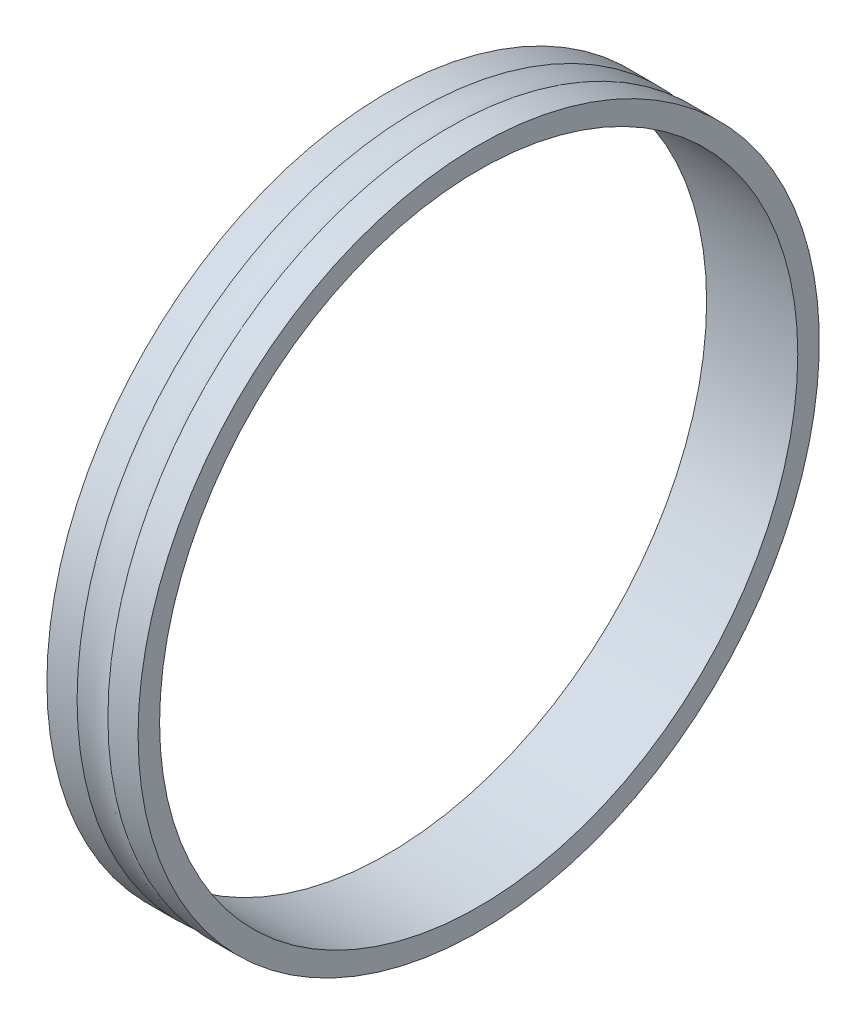
ISO-10303-21;
HEADER;
FILE_DESCRIPTION(('STEP AP214'),'2;1');
FILE_NAME('part.step','',(''),(''),'','','');
FILE_SCHEMA(('AUTOMOTIVE_DESIGN { 1 0 10303 214 1 1 1 1 }'));
ENDSEC;
DATA;
#1=APPLICATION_CONTEXT('core data for automotive mechanical design processes');
#2=APPLICATION_PROTOCOL_DEFINITION('international standard','automotive_design',2000,#1);
#3=PRODUCT_CONTEXT('',#1,'mechanical');
#4=PRODUCT('Part','Part','',(#3));
#5=PRODUCT_RELATED_PRODUCT_CATEGORY('part','',(#4));
#6=PRODUCT_DEFINITION_FORMATION('','',#4);
#7=PRODUCT_DEFINITION_CONTEXT('part definition',#1,'design');
#8=PRODUCT_DEFINITION('design','',#6,#7);
#9=PRODUCT_DEFINITION_SHAPE('','',#8);
#10=(LENGTH_UNIT() NAMED_UNIT(*) SI_UNIT(.MILLI.,.METRE.));
#11=(NAMED_UNIT(*) PLANE_ANGLE_UNIT() SI_UNIT($,.RADIAN.));
#12=(NAMED_UNIT(*) SI_UNIT($,.STERADIAN.) SOLID_ANGLE_UNIT());
#13=UNCERTAINTY_MEASURE_WITH_UNIT(LENGTH_MEASURE(1.E-05),#10,'distance_accuracy_value','');
#14=(GEOMETRIC_REPRESENTATION_CONTEXT(3) GLOBAL_UNCERTAINTY_ASSIGNED_CONTEXT((#13)) GLOBAL_UNIT_ASSIGNED_CONTEXT((#10,
#11,#12)) REPRESENTATION_CONTEXT('',''));
#15=CARTESIAN_POINT('',(0.,0.,0.));
#16=DIRECTION('',(0.,0.,1.));
#17=DIRECTION('',(1.,0.,0.));
#18=AXIS2_PLACEMENT_3D('',#15,#16,#17);
#19=CARTESIAN_POINT('',(49.75,0.,0.));
#20=DIRECTION('',(1.,0.,0.));
#21=DIRECTION('',(0.,0.,-1.));
#22=AXIS2_PLACEMENT_3D('',#19,#20,#21);
#23=TOROIDAL_SURFACE('',#22,52.9995,5.95);
#24=CARTESIAN_POINT('',(51.8960544610983,0.,0.));
#25=DIRECTION('',(-1.,0.,0.));
#26=DIRECTION('',(0.,0.,1.));
#27=AXIS2_PLACEMENT_3D('',#24,#25,#26);
#28=CIRCLE('',#27,47.45);
#29=CARTESIAN_POINT('',(51.8960544610983,0.,47.45));
#30=VERTEX_POINT('',#29);
#31=EDGE_CURVE('E31',#30,#30,#28,.F.);
#32=ORIENTED_EDGE('',*,*,#31,.F.);
#33=EDGE_LOOP('',(#32));
#34=FACE_BOUND('',#33,.T.);
#35=CARTESIAN_POINT('',(47.6039455389017,0.,0.));
#36=DIRECTION('',(-1.,0.,0.));
#37=DIRECTION('',(0.,0.,1.));
#38=AXIS2_PLACEMENT_3D('',#35,#36,#37);
#39=CIRCLE('',#38,47.45);
#40=CARTESIAN_POINT('',(47.6039455389017,0.,47.45));
#41=VERTEX_POINT('',#40);
#42=EDGE_CURVE('E36',#41,#41,#39,.T.);
#43=ORIENTED_EDGE('',*,*,#42,.F.);
#44=EDGE_LOOP('',(#43));
#45=FACE_BOUND('',#44,.T.);
#46=ADVANCED_FACE('F15',(#34,#45),#23,.F.);
#47=CARTESIAN_POINT('',(49.75,0.,0.));
#48=DIRECTION('',(-1.,0.,0.));
#49=DIRECTION('',(0.,0.,1.));
#50=AXIS2_PLACEMENT_3D('',#47,#48,#49);
#51=CYLINDRICAL_SURFACE('',#50,47.45);
#52=CARTESIAN_POINT('',(56.1,0.,0.));
#53=DIRECTION('',(-1.,0.,0.));
#54=DIRECTION('',(0.,0.,1.));
#55=AXIS2_PLACEMENT_3D('',#52,#53,#54);
#56=CIRCLE('',#55,47.45);
#57=CARTESIAN_POINT('',(56.1,0.,47.45));
#58=VERTEX_POINT('',#57);
#59=EDGE_CURVE('E19',#58,#58,#56,.F.);
#60=ORIENTED_EDGE('',*,*,#59,.F.);
#61=EDGE_LOOP('',(#60));
#62=FACE_BOUND('',#61,.T.);
#63=ORIENTED_EDGE('',*,*,#31,.T.);
#64=EDGE_LOOP('',(#63));
#65=FACE_BOUND('',#64,.T.);
#66=ADVANCED_FACE('F47',(#62,#65),#51,.T.);
#67=CARTESIAN_POINT('',(49.75,0.,0.));
#68=DIRECTION('',(-1.,0.,0.));
#69=DIRECTION('',(0.,0.,1.));
#70=AXIS2_PLACEMENT_3D('',#67,#68,#69);
#71=CYLINDRICAL_SURFACE('',#70,47.45);
#72=ORIENTED_EDGE('',*,*,#42,.T.);
#73=EDGE_LOOP('',(#72));
#74=FACE_BOUND('',#73,.T.);
#75=CARTESIAN_POINT('',(43.4,0.,0.));
#76=DIRECTION('',(-1.,0.,0.));
#77=DIRECTION('',(0.,0.,1.));
#78=AXIS2_PLACEMENT_3D('',#75,#76,#77);
#79=CIRCLE('',#78,47.45);
#80=CARTESIAN_POINT('',(43.4,0.,47.45));
#81=VERTEX_POINT('',#80);
#82=EDGE_CURVE('E28',#81,#81,#79,.T.);
#83=ORIENTED_EDGE('',*,*,#82,.F.);
#84=EDGE_LOOP('',(#83));
#85=FACE_BOUND('',#84,.T.);
#86=ADVANCED_FACE('F55',(#74,#85),#71,.T.);
#87=CARTESIAN_POINT('',(56.1,0.,45.95));
#88=DIRECTION('',(1.,0.,0.));
#89=DIRECTION('',(0.,0.,-1.));
#90=AXIS2_PLACEMENT_3D('',#87,#88,#89);
#91=PLANE('',#90);
#92=ORIENTED_EDGE('',*,*,#59,.T.);
#93=EDGE_LOOP('',(#92));
#94=FACE_BOUND('',#93,.T.);
#95=CARTESIAN_POINT('',(56.1,0.,0.));
#96=DIRECTION('',(-1.,0.,0.));
#97=DIRECTION('',(0.,0.,1.));
#98=AXIS2_PLACEMENT_3D('',#95,#96,#97);
#99=CIRCLE('',#98,44.45);
#100=CARTESIAN_POINT('',(56.1,0.,44.45));
#101=VERTEX_POINT('',#100);
#102=EDGE_CURVE('E23',#101,#101,#99,.T.);
#103=ORIENTED_EDGE('',*,*,#102,.T.);
#104=EDGE_LOOP('',(#103));
#105=FACE_BOUND('',#104,.T.);
#106=ADVANCED_FACE('F65',(#94,#105),#91,.T.);
#107=CARTESIAN_POINT('',(43.4,0.,45.95));
#108=DIRECTION('',(-1.,0.,0.));
#109=DIRECTION('',(0.,0.,1.));
#110=AXIS2_PLACEMENT_3D('',#107,#108,#109);
#111=PLANE('',#110);
#112=CARTESIAN_POINT('',(43.4,0.,0.));
#113=DIRECTION('',(-1.,0.,0.));
#114=DIRECTION('',(0.,0.,1.));
#115=AXIS2_PLACEMENT_3D('',#112,#113,#114);
#116=CIRCLE('',#115,44.45);
#117=CARTESIAN_POINT('',(43.4,0.,44.45));
#118=VERTEX_POINT('',#117);
#119=EDGE_CURVE('E10',#118,#118,#116,.F.);
#120=ORIENTED_EDGE('',*,*,#119,.T.);
#121=EDGE_LOOP('',(#120));
#122=FACE_BOUND('',#121,.T.);
#123=ORIENTED_EDGE('',*,*,#82,.T.);
#124=EDGE_LOOP('',(#123));
#125=FACE_BOUND('',#124,.T.);
#126=ADVANCED_FACE('F59',(#122,#125),#111,.T.);
#127=CARTESIAN_POINT('',(49.75,0.,0.));
#128=DIRECTION('',(-1.,0.,0.));
#129=DIRECTION('',(0.,0.,1.));
#130=AXIS2_PLACEMENT_3D('',#127,#128,#129);
#131=CYLINDRICAL_SURFACE('',#130,44.45);
#132=ORIENTED_EDGE('',*,*,#119,.F.);
#133=EDGE_LOOP('',(#132));
#134=FACE_BOUND('',#133,.T.);
#135=ORIENTED_EDGE('',*,*,#102,.F.);
#136=EDGE_LOOP('',(#135));
#137=FACE_BOUND('',#136,.T.);
#138=ADVANCED_FACE('F57',(#134,#137),#131,.F.);
#139=CLOSED_SHELL('',(#46,#66,#86,#106,#126,#138));
#140=MANIFOLD_SOLID_BREP('B1',#139);
#141=ADVANCED_BREP_SHAPE_REPRESENTATION('',(#18,#140),#14);
#142=SHAPE_DEFINITION_REPRESENTATION(#9,#141);
ENDSEC;
END-ISO-10303-21;
